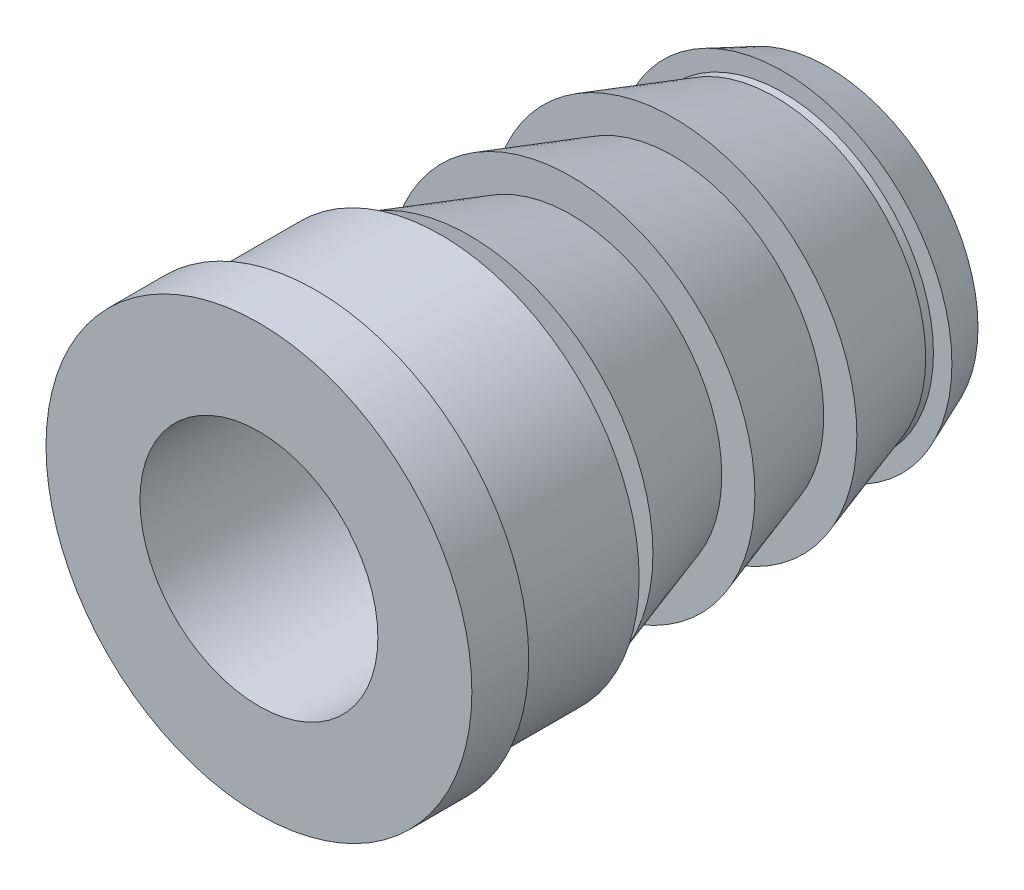
ISO-10303-21;
HEADER;
FILE_DESCRIPTION(('STEP AP214'),'2;1');
FILE_NAME('part.step','',(''),(''),'','','');
FILE_SCHEMA(('AUTOMOTIVE_DESIGN { 1 0 10303 214 1 1 1 1 }'));
ENDSEC;
DATA;
#1=APPLICATION_CONTEXT('core data for automotive mechanical design processes');
#2=APPLICATION_PROTOCOL_DEFINITION('international standard','automotive_design',2000,#1);
#3=PRODUCT_CONTEXT('',#1,'mechanical');
#4=PRODUCT('Part','Part','',(#3));
#5=PRODUCT_RELATED_PRODUCT_CATEGORY('part','',(#4));
#6=PRODUCT_DEFINITION_FORMATION('','',#4);
#7=PRODUCT_DEFINITION_CONTEXT('part definition',#1,'design');
#8=PRODUCT_DEFINITION('design','',#6,#7);
#9=PRODUCT_DEFINITION_SHAPE('','',#8);
#10=(LENGTH_UNIT() NAMED_UNIT(*) SI_UNIT(.MILLI.,.METRE.));
#11=(NAMED_UNIT(*) PLANE_ANGLE_UNIT() SI_UNIT($,.RADIAN.));
#12=(NAMED_UNIT(*) SI_UNIT($,.STERADIAN.) SOLID_ANGLE_UNIT());
#13=UNCERTAINTY_MEASURE_WITH_UNIT(LENGTH_MEASURE(1.E-05),#10,'distance_accuracy_value','');
#14=(GEOMETRIC_REPRESENTATION_CONTEXT(3) GLOBAL_UNCERTAINTY_ASSIGNED_CONTEXT((#13)) GLOBAL_UNIT_ASSIGNED_CONTEXT((#10,
#11,#12)) REPRESENTATION_CONTEXT('',''));
#15=CARTESIAN_POINT('',(0.,0.,0.));
#16=DIRECTION('',(0.,0.,1.));
#17=DIRECTION('',(1.,0.,0.));
#18=AXIS2_PLACEMENT_3D('',#15,#16,#17);
#19=CARTESIAN_POINT('',(0.,0.,2.39));
#20=DIRECTION('',(0.,0.,1.));
#21=DIRECTION('',(1.,0.,0.));
#22=AXIS2_PLACEMENT_3D('',#19,#20,#21);
#23=CYLINDRICAL_SURFACE('',#22,1.);
#24=CARTESIAN_POINT('',(0.,0.,-2.39));
#25=DIRECTION('',(0.,0.,1.));
#26=DIRECTION('',(1.,0.,0.));
#27=AXIS2_PLACEMENT_3D('',#24,#25,#26);
#28=CIRCLE('',#27,1.);
#29=CARTESIAN_POINT('',(1.,0.,-2.39));
#30=VERTEX_POINT('',#29);
#31=EDGE_CURVE('E112',#30,#30,#28,.T.);
#32=ORIENTED_EDGE('',*,*,#31,.F.);
#33=EDGE_LOOP('',(#32));
#34=FACE_BOUND('',#33,.T.);
#35=CARTESIAN_POINT('',(0.,0.,2.39));
#36=DIRECTION('',(0.,0.,1.));
#37=DIRECTION('',(1.,0.,0.));
#38=AXIS2_PLACEMENT_3D('',#35,#36,#37);
#39=CIRCLE('',#38,1.);
#40=CARTESIAN_POINT('',(1.,0.,2.39));
#41=VERTEX_POINT('',#40);
#42=EDGE_CURVE('E10',#41,#41,#39,.T.);
#43=ORIENTED_EDGE('',*,*,#42,.T.);
#44=EDGE_LOOP('',(#43));
#45=FACE_BOUND('',#44,.T.);
#46=ADVANCED_FACE('F41',(#34,#45),#23,.F.);
#47=CARTESIAN_POINT('',(0.,1.,2.39));
#48=DIRECTION('',(0.,0.,-1.));
#49=DIRECTION('',(-1.,0.,0.));
#50=AXIS2_PLACEMENT_3D('',#47,#48,#49);
#51=PLANE('',#50);
#52=ORIENTED_EDGE('',*,*,#42,.F.);
#53=EDGE_LOOP('',(#52));
#54=FACE_BOUND('',#53,.T.);
#55=CARTESIAN_POINT('',(0.,0.,2.39));
#56=DIRECTION('',(0.,0.,1.));
#57=DIRECTION('',(1.,0.,0.));
#58=AXIS2_PLACEMENT_3D('',#55,#56,#57);
#59=CIRCLE('',#58,1.79);
#60=CARTESIAN_POINT('',(1.79,0.,2.39));
#61=VERTEX_POINT('',#60);
#62=EDGE_CURVE('E48',#61,#61,#59,.T.);
#63=ORIENTED_EDGE('',*,*,#62,.T.);
#64=EDGE_LOOP('',(#63));
#65=FACE_BOUND('',#64,.T.);
#66=ADVANCED_FACE('F120',(#54,#65),#51,.F.);
#67=CARTESIAN_POINT('',(0.,0.,2.39));
#68=DIRECTION('',(0.,0.,1.));
#69=DIRECTION('',(1.,0.,0.));
#70=AXIS2_PLACEMENT_3D('',#67,#68,#69);
#71=CYLINDRICAL_SURFACE('',#70,1.79);
#72=ORIENTED_EDGE('',*,*,#62,.F.);
#73=EDGE_LOOP('',(#72));
#74=FACE_BOUND('',#73,.T.);
#75=CARTESIAN_POINT('',(0.,0.,1.912));
#76=DIRECTION('',(0.,0.,1.));
#77=DIRECTION('',(1.,0.,0.));
#78=AXIS2_PLACEMENT_3D('',#75,#76,#77);
#79=CIRCLE('',#78,1.79);
#80=CARTESIAN_POINT('',(1.79,0.,1.912));
#81=VERTEX_POINT('',#80);
#82=EDGE_CURVE('E53',#81,#81,#79,.T.);
#83=ORIENTED_EDGE('',*,*,#82,.T.);
#84=EDGE_LOOP('',(#83));
#85=FACE_BOUND('',#84,.T.);
#86=ADVANCED_FACE('F124',(#74,#85),#71,.T.);
#87=CARTESIAN_POINT('',(0.,1.79,1.912));
#88=DIRECTION('',(0.,0.,1.));
#89=DIRECTION('',(1.,0.,0.));
#90=AXIS2_PLACEMENT_3D('',#87,#88,#89);
#91=PLANE('',#90);
#92=ORIENTED_EDGE('',*,*,#82,.F.);
#93=EDGE_LOOP('',(#92));
#94=FACE_BOUND('',#93,.T.);
#95=CARTESIAN_POINT('',(0.,0.,1.912));
#96=DIRECTION('',(0.,0.,1.));
#97=DIRECTION('',(1.,0.,0.));
#98=AXIS2_PLACEMENT_3D('',#95,#96,#97);
#99=CIRCLE('',#98,1.66666666666667);
#100=CARTESIAN_POINT('',(1.66666666666667,0.,1.912));
#101=VERTEX_POINT('',#100);
#102=EDGE_CURVE('E58',#101,#101,#99,.T.);
#103=ORIENTED_EDGE('',*,*,#102,.T.);
#104=EDGE_LOOP('',(#103));
#105=FACE_BOUND('',#104,.T.);
#106=ADVANCED_FACE('F129',(#94,#105),#91,.F.);
#107=CARTESIAN_POINT('',(0.,0.,2.39));
#108=DIRECTION('',(0.,0.,1.));
#109=DIRECTION('',(1.,0.,0.));
#110=AXIS2_PLACEMENT_3D('',#107,#108,#109);
#111=CYLINDRICAL_SURFACE('',#110,1.66666666666667);
#112=ORIENTED_EDGE('',*,*,#102,.F.);
#113=EDGE_LOOP('',(#112));
#114=FACE_BOUND('',#113,.T.);
#115=CARTESIAN_POINT('',(0.,0.,0.8604));
#116=DIRECTION('',(0.,0.,1.));
#117=DIRECTION('',(1.,0.,0.));
#118=AXIS2_PLACEMENT_3D('',#115,#116,#117);
#119=CIRCLE('',#118,1.66666666666667);
#120=CARTESIAN_POINT('',(1.66666666666667,0.,0.8604));
#121=VERTEX_POINT('',#120);
#122=EDGE_CURVE('E64',#121,#121,#119,.T.);
#123=ORIENTED_EDGE('',*,*,#122,.T.);
#124=EDGE_LOOP('',(#123));
#125=FACE_BOUND('',#124,.T.);
#126=ADVANCED_FACE('F135',(#114,#125),#111,.T.);
#127=CARTESIAN_POINT('',(0.,1.66666666666667,0.8604));
#128=DIRECTION('',(0.,0.,1.));
#129=DIRECTION('',(1.,0.,0.));
#130=AXIS2_PLACEMENT_3D('',#127,#128,#129);
#131=PLANE('',#130);
#132=ORIENTED_EDGE('',*,*,#122,.F.);
#133=EDGE_LOOP('',(#132));
#134=FACE_BOUND('',#133,.T.);
#135=CARTESIAN_POINT('',(0.,0.,0.8604));
#136=DIRECTION('',(0.,0.,1.));
#137=DIRECTION('',(1.,0.,0.));
#138=AXIS2_PLACEMENT_3D('',#135,#136,#137);
#139=CIRCLE('',#138,1.2648);
#140=CARTESIAN_POINT('',(1.2648,0.,0.8604));
#141=VERTEX_POINT('',#140);
#142=EDGE_CURVE('E68',#141,#141,#139,.T.);
#143=ORIENTED_EDGE('',*,*,#142,.T.);
#144=EDGE_LOOP('',(#143));
#145=FACE_BOUND('',#144,.T.);
#146=ADVANCED_FACE('F139',(#134,#145),#131,.F.);
#147=CARTESIAN_POINT('',(0.,0.,2.39));
#148=DIRECTION('',(0.,0.,1.));
#149=DIRECTION('',(1.,0.,0.));
#150=AXIS2_PLACEMENT_3D('',#147,#148,#149);
#151=CYLINDRICAL_SURFACE('',#150,1.2648);
#152=ORIENTED_EDGE('',*,*,#142,.F.);
#153=EDGE_LOOP('',(#152));
#154=FACE_BOUND('',#153,.T.);
#155=CARTESIAN_POINT('',(0.,0.,0.621400000000001));
#156=DIRECTION('',(0.,0.,1.));
#157=DIRECTION('',(1.,0.,0.));
#158=AXIS2_PLACEMENT_3D('',#155,#156,#157);
#159=CIRCLE('',#158,1.2648);
#160=CARTESIAN_POINT('',(1.2648,0.,0.621400000000001));
#161=VERTEX_POINT('',#160);
#162=EDGE_CURVE('E72',#161,#161,#159,.T.);
#163=ORIENTED_EDGE('',*,*,#162,.T.);
#164=EDGE_LOOP('',(#163));
#165=FACE_BOUND('',#164,.T.);
#166=ADVANCED_FACE('F143',(#154,#165),#151,.T.);
#167=CARTESIAN_POINT('',(0.,1.2648,0.621400000000001));
#168=DIRECTION('',(0.,0.,-1.));
#169=DIRECTION('',(-1.,0.,0.));
#170=AXIS2_PLACEMENT_3D('',#167,#168,#169);
#171=PLANE('',#170);
#172=ORIENTED_EDGE('',*,*,#162,.F.);
#173=EDGE_LOOP('',(#172));
#174=FACE_BOUND('',#173,.T.);
#175=CARTESIAN_POINT('',(0.,0.,0.621400000000001));
#176=DIRECTION('',(0.,0.,1.));
#177=DIRECTION('',(1.,0.,0.));
#178=AXIS2_PLACEMENT_3D('',#175,#176,#177);
#179=CIRCLE('',#178,1.54333333333333);
#180=CARTESIAN_POINT('',(1.54333333333333,0.,0.621400000000001));
#181=VERTEX_POINT('',#180);
#182=EDGE_CURVE('E76',#181,#181,#179,.T.);
#183=ORIENTED_EDGE('',*,*,#182,.T.);
#184=EDGE_LOOP('',(#183));
#185=FACE_BOUND('',#184,.T.);
#186=ADVANCED_FACE('F147',(#174,#185),#171,.F.);
#187=CARTESIAN_POINT('',(0.,0.,-0.235837454554544));
#188=DIRECTION('',(0.,0.,1.));
#189=DIRECTION('',(1.,0.,0.));
#190=AXIS2_PLACEMENT_3D('',#187,#188,#189);
#191=CONICAL_SURFACE('',#190,1.2648,0.31415926535898);
#192=ORIENTED_EDGE('',*,*,#182,.F.);
#193=EDGE_LOOP('',(#192));
#194=FACE_BOUND('',#193,.T.);
#195=CARTESIAN_POINT('',(0.,0.,-0.235837454554544));
#196=DIRECTION('',(0.,0.,1.));
#197=DIRECTION('',(1.,0.,0.));
#198=AXIS2_PLACEMENT_3D('',#195,#196,#197);
#199=CIRCLE('',#198,1.2648);
#200=CARTESIAN_POINT('',(1.2648,0.,-0.235837454554544));
#201=VERTEX_POINT('',#200);
#202=EDGE_CURVE('E80',#201,#201,#199,.T.);
#203=ORIENTED_EDGE('',*,*,#202,.T.);
#204=EDGE_LOOP('',(#203));
#205=FACE_BOUND('',#204,.T.);
#206=ADVANCED_FACE('F151',(#194,#205),#191,.T.);
#207=CARTESIAN_POINT('',(0.,1.2648,-0.235837454554544));
#208=DIRECTION('',(0.,0.,-1.));
#209=DIRECTION('',(-1.,0.,0.));
#210=AXIS2_PLACEMENT_3D('',#207,#208,#209);
#211=PLANE('',#210);
#212=ORIENTED_EDGE('',*,*,#202,.F.);
#213=EDGE_LOOP('',(#212));
#214=FACE_BOUND('',#213,.T.);
#215=CARTESIAN_POINT('',(0.,0.,-0.235837454554544));
#216=DIRECTION('',(0.,0.,1.));
#217=DIRECTION('',(1.,0.,0.));
#218=AXIS2_PLACEMENT_3D('',#215,#216,#217);
#219=CIRCLE('',#218,1.54333333333333);
#220=CARTESIAN_POINT('',(1.54333333333333,0.,-0.235837454554544));
#221=VERTEX_POINT('',#220);
#222=EDGE_CURVE('E84',#221,#221,#219,.T.);
#223=ORIENTED_EDGE('',*,*,#222,.T.);
#224=EDGE_LOOP('',(#223));
#225=FACE_BOUND('',#224,.T.);
#226=ADVANCED_FACE('F155',(#214,#225),#211,.F.);
#227=CARTESIAN_POINT('',(0.,0.,-1.09307490910909));
#228=DIRECTION('',(0.,0.,1.));
#229=DIRECTION('',(1.,0.,0.));
#230=AXIS2_PLACEMENT_3D('',#227,#228,#229);
#231=CONICAL_SURFACE('',#230,1.2648,0.31415926535898);
#232=ORIENTED_EDGE('',*,*,#222,.F.);
#233=EDGE_LOOP('',(#232));
#234=FACE_BOUND('',#233,.T.);
#235=CARTESIAN_POINT('',(0.,0.,-1.09307490910909));
#236=DIRECTION('',(0.,0.,1.));
#237=DIRECTION('',(1.,0.,0.));
#238=AXIS2_PLACEMENT_3D('',#235,#236,#237);
#239=CIRCLE('',#238,1.2648);
#240=CARTESIAN_POINT('',(1.2648,0.,-1.09307490910909));
#241=VERTEX_POINT('',#240);
#242=EDGE_CURVE('E88',#241,#241,#239,.T.);
#243=ORIENTED_EDGE('',*,*,#242,.T.);
#244=EDGE_LOOP('',(#243));
#245=FACE_BOUND('',#244,.T.);
#246=ADVANCED_FACE('F159',(#234,#245),#231,.T.);
#247=CARTESIAN_POINT('',(0.,1.2648,-1.09307490910909));
#248=DIRECTION('',(0.,0.,-1.));
#249=DIRECTION('',(-1.,0.,0.));
#250=AXIS2_PLACEMENT_3D('',#247,#248,#249);
#251=PLANE('',#250);
#252=ORIENTED_EDGE('',*,*,#242,.F.);
#253=EDGE_LOOP('',(#252));
#254=FACE_BOUND('',#253,.T.);
#255=CARTESIAN_POINT('',(0.,0.,-1.09307490910909));
#256=DIRECTION('',(0.,0.,1.));
#257=DIRECTION('',(1.,0.,0.));
#258=AXIS2_PLACEMENT_3D('',#255,#256,#257);
#259=CIRCLE('',#258,1.54333333333333);
#260=CARTESIAN_POINT('',(1.54333333333333,0.,-1.09307490910909));
#261=VERTEX_POINT('',#260);
#262=EDGE_CURVE('E92',#261,#261,#259,.T.);
#263=ORIENTED_EDGE('',*,*,#262,.T.);
#264=EDGE_LOOP('',(#263));
#265=FACE_BOUND('',#264,.T.);
#266=ADVANCED_FACE('F163',(#254,#265),#251,.F.);
#267=CARTESIAN_POINT('',(0.,0.,-1.95031236366363));
#268=DIRECTION('',(0.,0.,1.));
#269=DIRECTION('',(1.,0.,0.));
#270=AXIS2_PLACEMENT_3D('',#267,#268,#269);
#271=CONICAL_SURFACE('',#270,1.2648,0.31415926535898);
#272=ORIENTED_EDGE('',*,*,#262,.F.);
#273=EDGE_LOOP('',(#272));
#274=FACE_BOUND('',#273,.T.);
#275=CARTESIAN_POINT('',(0.,0.,-1.95031236366363));
#276=DIRECTION('',(0.,0.,1.));
#277=DIRECTION('',(1.,0.,0.));
#278=AXIS2_PLACEMENT_3D('',#275,#276,#277);
#279=CIRCLE('',#278,1.2648);
#280=CARTESIAN_POINT('',(1.2648,0.,-1.95031236366363));
#281=VERTEX_POINT('',#280);
#282=EDGE_CURVE('E96',#281,#281,#279,.T.);
#283=ORIENTED_EDGE('',*,*,#282,.T.);
#284=EDGE_LOOP('',(#283));
#285=FACE_BOUND('',#284,.T.);
#286=ADVANCED_FACE('F167',(#274,#285),#271,.T.);
#287=CARTESIAN_POINT('',(0.,0.,2.39));
#288=DIRECTION('',(0.,0.,1.));
#289=DIRECTION('',(1.,0.,0.));
#290=AXIS2_PLACEMENT_3D('',#287,#288,#289);
#291=CYLINDRICAL_SURFACE('',#290,1.2648);
#292=ORIENTED_EDGE('',*,*,#282,.F.);
#293=EDGE_LOOP('',(#292));
#294=FACE_BOUND('',#293,.T.);
#295=CARTESIAN_POINT('',(0.,0.,-2.0153140551197));
#296=DIRECTION('',(0.,0.,1.));
#297=DIRECTION('',(1.,0.,0.));
#298=AXIS2_PLACEMENT_3D('',#295,#296,#297);
#299=CIRCLE('',#298,1.2648);
#300=CARTESIAN_POINT('',(1.2648,0.,-2.0153140551197));
#301=VERTEX_POINT('',#300);
#302=EDGE_CURVE('E100',#301,#301,#299,.T.);
#303=ORIENTED_EDGE('',*,*,#302,.T.);
#304=EDGE_LOOP('',(#303));
#305=FACE_BOUND('',#304,.T.);
#306=ADVANCED_FACE('F171',(#294,#305),#291,.T.);
#307=CARTESIAN_POINT('',(0.,1.2648,-2.0153140551197));
#308=DIRECTION('',(0.,0.,-1.));
#309=DIRECTION('',(-1.,0.,0.));
#310=AXIS2_PLACEMENT_3D('',#307,#308,#309);
#311=PLANE('',#310);
#312=ORIENTED_EDGE('',*,*,#302,.F.);
#313=EDGE_LOOP('',(#312));
#314=FACE_BOUND('',#313,.T.);
#315=CARTESIAN_POINT('',(0.,0.,-2.0153140551197));
#316=DIRECTION('',(0.,0.,1.));
#317=DIRECTION('',(1.,0.,0.));
#318=AXIS2_PLACEMENT_3D('',#315,#316,#317);
#319=CIRCLE('',#318,1.42);
#320=CARTESIAN_POINT('',(1.42,0.,-2.0153140551197));
#321=VERTEX_POINT('',#320);
#322=EDGE_CURVE('E104',#321,#321,#319,.T.);
#323=ORIENTED_EDGE('',*,*,#322,.T.);
#324=EDGE_LOOP('',(#323));
#325=FACE_BOUND('',#324,.T.);
#326=ADVANCED_FACE('F175',(#314,#325),#311,.F.);
#327=CARTESIAN_POINT('',(0.,0.,-2.39));
#328=DIRECTION('',(0.,0.,1.));
#329=DIRECTION('',(1.,0.,0.));
#330=AXIS2_PLACEMENT_3D('',#327,#328,#329);
#331=CONICAL_SURFACE('',#330,1.2648,0.392699081698725);
#332=ORIENTED_EDGE('',*,*,#322,.F.);
#333=EDGE_LOOP('',(#332));
#334=FACE_BOUND('',#333,.T.);
#335=CARTESIAN_POINT('',(0.,0.,-2.39));
#336=DIRECTION('',(0.,0.,1.));
#337=DIRECTION('',(1.,0.,0.));
#338=AXIS2_PLACEMENT_3D('',#335,#336,#337);
#339=CIRCLE('',#338,1.2648);
#340=CARTESIAN_POINT('',(1.2648,0.,-2.39));
#341=VERTEX_POINT('',#340);
#342=EDGE_CURVE('E108',#341,#341,#339,.T.);
#343=ORIENTED_EDGE('',*,*,#342,.T.);
#344=EDGE_LOOP('',(#343));
#345=FACE_BOUND('',#344,.T.);
#346=ADVANCED_FACE('F179',(#334,#345),#331,.T.);
#347=CARTESIAN_POINT('',(0.,1.2648,-2.39));
#348=DIRECTION('',(0.,0.,1.));
#349=DIRECTION('',(1.,0.,0.));
#350=AXIS2_PLACEMENT_3D('',#347,#348,#349);
#351=PLANE('',#350);
#352=ORIENTED_EDGE('',*,*,#342,.F.);
#353=EDGE_LOOP('',(#352));
#354=FACE_BOUND('',#353,.T.);
#355=ORIENTED_EDGE('',*,*,#31,.T.);
#356=EDGE_LOOP('',(#355));
#357=FACE_BOUND('',#356,.T.);
#358=ADVANCED_FACE('F117',(#354,#357),#351,.F.);
#359=CLOSED_SHELL('',(#46,#66,#86,#106,#126,#146,#166,#186,#206,#226,#246,#266,#286,#306,#326,
#346,#358));
#360=MANIFOLD_SOLID_BREP('B2',#359);
#361=ADVANCED_BREP_SHAPE_REPRESENTATION('',(#18,#360),#14);
#362=SHAPE_DEFINITION_REPRESENTATION(#9,#361);
ENDSEC;
END-ISO-10303-21;
